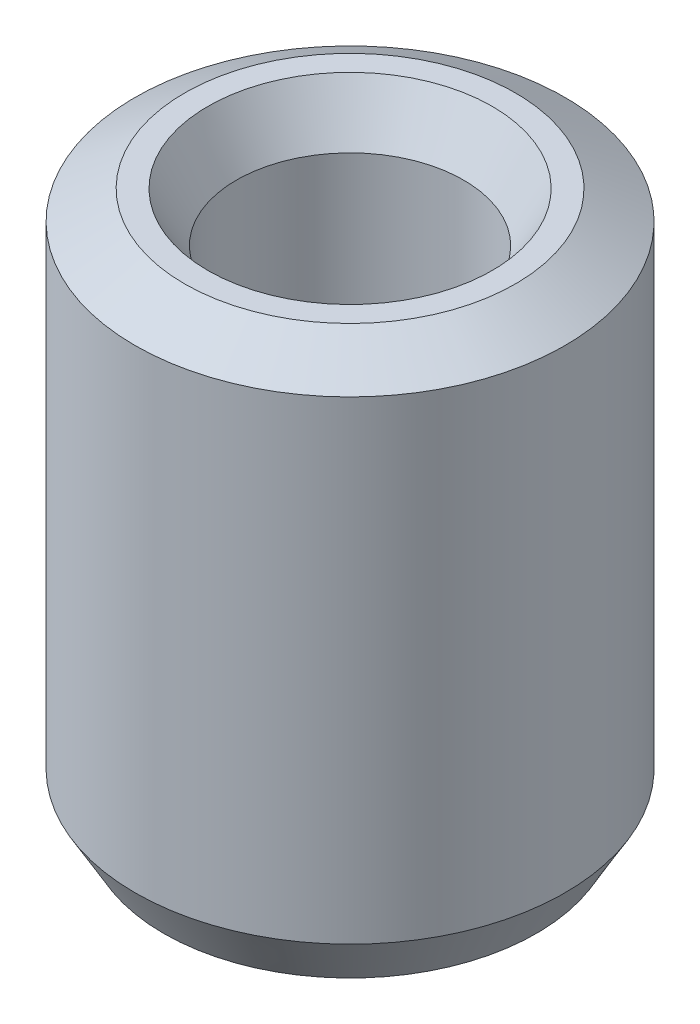
ISO-10303-21;
HEADER;
FILE_DESCRIPTION(('STEP AP214'),'2;1');
FILE_NAME('part.step','',(''),(''),'','','');
FILE_SCHEMA(('AUTOMOTIVE_DESIGN { 1 0 10303 214 1 1 1 1 }'));
ENDSEC;
DATA;
#1=APPLICATION_CONTEXT('core data for automotive mechanical design processes');
#2=APPLICATION_PROTOCOL_DEFINITION('international standard','automotive_design',2000,#1);
#3=PRODUCT_CONTEXT('',#1,'mechanical');
#4=PRODUCT('Part','Part','',(#3));
#5=PRODUCT_RELATED_PRODUCT_CATEGORY('part','',(#4));
#6=PRODUCT_DEFINITION_FORMATION('','',#4);
#7=PRODUCT_DEFINITION_CONTEXT('part definition',#1,'design');
#8=PRODUCT_DEFINITION('design','',#6,#7);
#9=PRODUCT_DEFINITION_SHAPE('','',#8);
#10=(LENGTH_UNIT() NAMED_UNIT(*) SI_UNIT(.MILLI.,.METRE.));
#11=(NAMED_UNIT(*) PLANE_ANGLE_UNIT() SI_UNIT($,.RADIAN.));
#12=(NAMED_UNIT(*) SI_UNIT($,.STERADIAN.) SOLID_ANGLE_UNIT());
#13=UNCERTAINTY_MEASURE_WITH_UNIT(LENGTH_MEASURE(1.E-05),#10,'distance_accuracy_value','');
#14=(GEOMETRIC_REPRESENTATION_CONTEXT(3) GLOBAL_UNCERTAINTY_ASSIGNED_CONTEXT((#13)) GLOBAL_UNIT_ASSIGNED_CONTEXT((#10,
#11,#12)) REPRESENTATION_CONTEXT('',''));
#15=CARTESIAN_POINT('',(0.,0.,0.));
#16=DIRECTION('',(0.,0.,1.));
#17=DIRECTION('',(1.,0.,0.));
#18=AXIS2_PLACEMENT_3D('',#15,#16,#17);
#19=CARTESIAN_POINT('',(0.,25.682748699816,0.));
#20=DIRECTION('',(0.,-1.,0.));
#21=DIRECTION('',(0.,0.,-1.));
#22=AXIS2_PLACEMENT_3D('',#19,#20,#21);
#23=CYLINDRICAL_SURFACE('',#22,10.);
#24=CARTESIAN_POINT('',(0.,2.30415685918671,0.));
#25=DIRECTION('',(0.,1.,0.));
#26=DIRECTION('',(0.,0.,1.));
#27=AXIS2_PLACEMENT_3D('',#24,#25,#26);
#28=CIRCLE('',#27,10.);
#29=CARTESIAN_POINT('',(0.,2.30415685918671,10.));
#30=VERTEX_POINT('',#29);
#31=EDGE_CURVE('E10',#30,#30,#28,.T.);
#32=ORIENTED_EDGE('',*,*,#31,.T.);
#33=EDGE_LOOP('',(#32));
#34=FACE_BOUND('',#33,.T.);
#35=CARTESIAN_POINT('',(0.,24.3524431169095,0.));
#36=DIRECTION('',(0.,1.,0.));
#37=DIRECTION('',(0.,0.,1.));
#38=AXIS2_PLACEMENT_3D('',#35,#36,#37);
#39=CIRCLE('',#38,10.);
#40=CARTESIAN_POINT('',(0.,24.3524431169095,10.));
#41=VERTEX_POINT('',#40);
#42=EDGE_CURVE('E50',#41,#41,#39,.F.);
#43=ORIENTED_EDGE('',*,*,#42,.T.);
#44=EDGE_LOOP('',(#43));
#45=FACE_BOUND('',#44,.T.);
#46=ADVANCED_FACE('F39',(#34,#45),#23,.T.);
#47=CARTESIAN_POINT('',(0.,25.682748699816,0.));
#48=DIRECTION('',(0.,1.,0.));
#49=DIRECTION('',(0.,0.,1.));
#50=AXIS2_PLACEMENT_3D('',#47,#48,#49);
#51=PLANE('',#50);
#52=CARTESIAN_POINT('',(0.,25.682748699816,0.));
#53=DIRECTION('',(0.,1.,0.));
#54=DIRECTION('',(0.,0.,1.));
#55=AXIS2_PLACEMENT_3D('',#52,#53,#54);
#56=CIRCLE('',#55,6.61528109448043);
#57=CARTESIAN_POINT('',(0.,25.682748699816,6.61528109448043));
#58=VERTEX_POINT('',#57);
#59=EDGE_CURVE('E58',#58,#58,#56,.F.);
#60=ORIENTED_EDGE('',*,*,#59,.T.);
#61=EDGE_LOOP('',(#60));
#62=FACE_BOUND('',#61,.T.);
#63=CARTESIAN_POINT('',(0.,25.682748699816,0.));
#64=DIRECTION('',(0.,1.,0.));
#65=DIRECTION('',(0.,0.,1.));
#66=AXIS2_PLACEMENT_3D('',#63,#64,#65);
#67=CIRCLE('',#66,7.69584314081329);
#68=CARTESIAN_POINT('',(0.,25.682748699816,7.69584314081329));
#69=VERTEX_POINT('',#68);
#70=EDGE_CURVE('E61',#69,#69,#67,.T.);
#71=ORIENTED_EDGE('',*,*,#70,.T.);
#72=EDGE_LOOP('',(#71));
#73=FACE_BOUND('',#72,.T.);
#74=ADVANCED_FACE('F88',(#62,#73),#51,.T.);
#75=CARTESIAN_POINT('',(0.,0.,0.));
#76=DIRECTION('',(0.,1.,0.));
#77=DIRECTION('',(0.,0.,1.));
#78=AXIS2_PLACEMENT_3D('',#75,#76,#77);
#79=PLANE('',#78);
#80=CARTESIAN_POINT('',(0.,0.,0.));
#81=DIRECTION('',(0.,1.,0.));
#82=DIRECTION('',(0.,0.,1.));
#83=AXIS2_PLACEMENT_3D('',#80,#81,#82);
#84=CIRCLE('',#83,7.58913237076057);
#85=CARTESIAN_POINT('',(0.,0.,7.58913237076057));
#86=VERTEX_POINT('',#85);
#87=EDGE_CURVE('E51',#86,#86,#84,.T.);
#88=ORIENTED_EDGE('',*,*,#87,.T.);
#89=EDGE_LOOP('',(#88));
#90=FACE_BOUND('',#89,.T.);
#91=CARTESIAN_POINT('',(0.,0.,0.));
#92=DIRECTION('',(0.,1.,0.));
#93=DIRECTION('',(0.,0.,1.));
#94=AXIS2_PLACEMENT_3D('',#91,#92,#93);
#95=CIRCLE('',#94,8.66969441709342);
#96=CARTESIAN_POINT('',(0.,0.,8.66969441709342));
#97=VERTEX_POINT('',#96);
#98=EDGE_CURVE('E54',#97,#97,#95,.F.);
#99=ORIENTED_EDGE('',*,*,#98,.T.);
#100=EDGE_LOOP('',(#99));
#101=FACE_BOUND('',#100,.T.);
#102=ADVANCED_FACE('F83',(#90,#101),#79,.F.);
#103=CARTESIAN_POINT('',(0.,25.682748699816,0.));
#104=DIRECTION('',(0.,-1.,0.));
#105=DIRECTION('',(0.,0.,-1.));
#106=AXIS2_PLACEMENT_3D('',#103,#104,#105);
#107=CYLINDRICAL_SURFACE('',#106,5.28497551157385);
#108=CARTESIAN_POINT('',(0.,23.3785918406293,0.));
#109=DIRECTION('',(0.,1.,0.));
#110=DIRECTION('',(0.,0.,1.));
#111=AXIS2_PLACEMENT_3D('',#108,#109,#110);
#112=CIRCLE('',#111,5.28497551157385);
#113=CARTESIAN_POINT('',(0.,23.3785918406293,5.28497551157385));
#114=VERTEX_POINT('',#113);
#115=EDGE_CURVE('E67',#114,#114,#112,.T.);
#116=ORIENTED_EDGE('',*,*,#115,.T.);
#117=EDGE_LOOP('',(#116));
#118=FACE_BOUND('',#117,.T.);
#119=CARTESIAN_POINT('',(0.,1.33030558290659,0.));
#120=DIRECTION('',(0.,1.,0.));
#121=DIRECTION('',(0.,0.,1.));
#122=AXIS2_PLACEMENT_3D('',#119,#120,#121);
#123=CIRCLE('',#122,5.28497551157385);
#124=CARTESIAN_POINT('',(0.,1.33030558290659,5.28497551157385));
#125=VERTEX_POINT('',#124);
#126=EDGE_CURVE('E69',#125,#125,#123,.F.);
#127=ORIENTED_EDGE('',*,*,#126,.T.);
#128=EDGE_LOOP('',(#127));
#129=FACE_BOUND('',#128,.T.);
#130=ADVANCED_FACE('F71',(#118,#129),#107,.F.);
#131=CARTESIAN_POINT('',(0.,23.3785918406293,0.));
#132=DIRECTION('',(0.,1.,0.));
#133=DIRECTION('',(0.,0.,1.));
#134=AXIS2_PLACEMENT_3D('',#131,#132,#133);
#135=CONICAL_SURFACE('',#134,5.28497551157385,0.5235987755983);
#136=ORIENTED_EDGE('',*,*,#59,.F.);
#137=EDGE_LOOP('',(#136));
#138=FACE_BOUND('',#137,.T.);
#139=ORIENTED_EDGE('',*,*,#115,.F.);
#140=EDGE_LOOP('',(#139));
#141=FACE_BOUND('',#140,.T.);
#142=ADVANCED_FACE('F77',(#138,#141),#135,.F.);
#143=CARTESIAN_POINT('',(0.,0.,0.));
#144=DIRECTION('',(0.,-1.,0.));
#145=DIRECTION('',(0.,0.,-1.));
#146=AXIS2_PLACEMENT_3D('',#143,#144,#145);
#147=CONICAL_SURFACE('',#146,7.58913237076057,1.04719755119659);
#148=ORIENTED_EDGE('',*,*,#126,.F.);
#149=EDGE_LOOP('',(#148));
#150=FACE_BOUND('',#149,.T.);
#151=ORIENTED_EDGE('',*,*,#87,.F.);
#152=EDGE_LOOP('',(#151));
#153=FACE_BOUND('',#152,.T.);
#154=ADVANCED_FACE('F73',(#150,#153),#147,.F.);
#155=CARTESIAN_POINT('',(0.,2.30415685918671,0.));
#156=DIRECTION('',(0.,1.,0.));
#157=DIRECTION('',(0.,0.,1.));
#158=AXIS2_PLACEMENT_3D('',#155,#156,#157);
#159=CONICAL_SURFACE('',#158,10.,0.523598775598303);
#160=ORIENTED_EDGE('',*,*,#98,.F.);
#161=EDGE_LOOP('',(#160));
#162=FACE_BOUND('',#161,.T.);
#163=ORIENTED_EDGE('',*,*,#31,.F.);
#164=EDGE_LOOP('',(#163));
#165=FACE_BOUND('',#164,.T.);
#166=ADVANCED_FACE('F76',(#162,#165),#159,.T.);
#167=CARTESIAN_POINT('',(0.,25.682748699816,0.));
#168=DIRECTION('',(0.,-1.,0.));
#169=DIRECTION('',(0.,0.,-1.));
#170=AXIS2_PLACEMENT_3D('',#167,#168,#169);
#171=CONICAL_SURFACE('',#170,7.69584314081329,1.04719755119659);
#172=ORIENTED_EDGE('',*,*,#42,.F.);
#173=EDGE_LOOP('',(#172));
#174=FACE_BOUND('',#173,.T.);
#175=ORIENTED_EDGE('',*,*,#70,.F.);
#176=EDGE_LOOP('',(#175));
#177=FACE_BOUND('',#176,.T.);
#178=ADVANCED_FACE('F45',(#174,#177),#171,.T.);
#179=CLOSED_SHELL('',(#46,#74,#102,#130,#142,#154,#166,#178));
#180=MANIFOLD_SOLID_BREP('B2',#179);
#181=ADVANCED_BREP_SHAPE_REPRESENTATION('',(#18,#180),#14);
#182=SHAPE_DEFINITION_REPRESENTATION(#9,#181);
ENDSEC;
END-ISO-10303-21;
